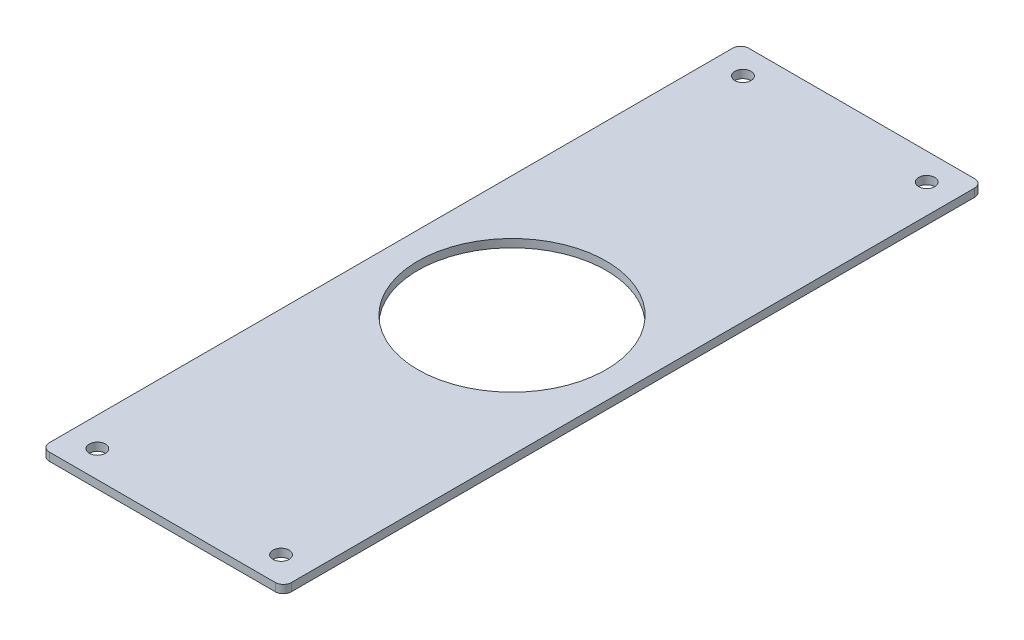
ISO-10303-21;
HEADER;
FILE_DESCRIPTION(('STEP AP214'),'2;1');
FILE_NAME('part.step','',(''),(''),'','','');
FILE_SCHEMA(('AUTOMOTIVE_DESIGN { 1 0 10303 214 1 1 1 1 }'));
ENDSEC;
DATA;
#1=APPLICATION_CONTEXT('core data for automotive mechanical design processes');
#2=APPLICATION_PROTOCOL_DEFINITION('international standard','automotive_design',2000,#1);
#3=PRODUCT_CONTEXT('',#1,'mechanical');
#4=PRODUCT('Part','Part','',(#3));
#5=PRODUCT_RELATED_PRODUCT_CATEGORY('part','',(#4));
#6=PRODUCT_DEFINITION_FORMATION('','',#4);
#7=PRODUCT_DEFINITION_CONTEXT('part definition',#1,'design');
#8=PRODUCT_DEFINITION('design','',#6,#7);
#9=PRODUCT_DEFINITION_SHAPE('','',#8);
#10=(LENGTH_UNIT() NAMED_UNIT(*) SI_UNIT(.MILLI.,.METRE.));
#11=(NAMED_UNIT(*) PLANE_ANGLE_UNIT() SI_UNIT($,.RADIAN.));
#12=(NAMED_UNIT(*) SI_UNIT($,.STERADIAN.) SOLID_ANGLE_UNIT());
#13=UNCERTAINTY_MEASURE_WITH_UNIT(LENGTH_MEASURE(1.E-05),#10,'distance_accuracy_value','');
#14=(GEOMETRIC_REPRESENTATION_CONTEXT(3) GLOBAL_UNCERTAINTY_ASSIGNED_CONTEXT((#13)) GLOBAL_UNIT_ASSIGNED_CONTEXT((#10,
#11,#12)) REPRESENTATION_CONTEXT('',''));
#15=CARTESIAN_POINT('',(0.,0.,0.));
#16=DIRECTION('',(0.,0.,1.));
#17=DIRECTION('',(1.,0.,0.));
#18=AXIS2_PLACEMENT_3D('',#15,#16,#17);
#19=CARTESIAN_POINT('',(0.,3.,0.));
#20=DIRECTION('',(0.,-1.,0.));
#21=DIRECTION('',(0.,0.,-1.));
#22=AXIS2_PLACEMENT_3D('',#19,#20,#21);
#23=PLANE('',#22);
#24=DIRECTION('',(-1.,0.,0.));
#25=VECTOR('',#24,1.);
#26=CARTESIAN_POINT('',(-45.,3.,-130.));
#27=LINE('',#26,#25);
#28=CARTESIAN_POINT('',(42.,3.,-130.));
#29=VERTEX_POINT('',#28);
#30=CARTESIAN_POINT('',(-42.,3.,-130.));
#31=VERTEX_POINT('',#30);
#32=EDGE_CURVE('E169',#29,#31,#27,.T.);
#33=ORIENTED_EDGE('',*,*,#32,.T.);
#34=CARTESIAN_POINT('',(-42.,3.,-127.));
#35=DIRECTION('',(0.,-1.,0.));
#36=DIRECTION('',(0.,0.,-1.));
#37=AXIS2_PLACEMENT_3D('',#34,#35,#36);
#38=CIRCLE('',#37,3.);
#39=CARTESIAN_POINT('',(-45.,3.,-127.));
#40=VERTEX_POINT('',#39);
#41=EDGE_CURVE('E149',#31,#40,#38,.F.);
#42=ORIENTED_EDGE('',*,*,#41,.T.);
#43=DIRECTION('',(0.,0.,1.));
#44=VECTOR('',#43,1.);
#45=CARTESIAN_POINT('',(-45.,3.,130.));
#46=LINE('',#45,#44);
#47=CARTESIAN_POINT('',(-45.,3.,127.));
#48=VERTEX_POINT('',#47);
#49=EDGE_CURVE('E119',#40,#48,#46,.T.);
#50=ORIENTED_EDGE('',*,*,#49,.T.);
#51=CARTESIAN_POINT('',(-42.,3.,127.));
#52=DIRECTION('',(0.,-1.,0.));
#53=DIRECTION('',(0.,0.,-1.));
#54=AXIS2_PLACEMENT_3D('',#51,#52,#53);
#55=CIRCLE('',#54,3.);
#56=CARTESIAN_POINT('',(-42.,3.,130.));
#57=VERTEX_POINT('',#56);
#58=EDGE_CURVE('E55',#48,#57,#55,.F.);
#59=ORIENTED_EDGE('',*,*,#58,.T.);
#60=DIRECTION('',(1.,0.,0.));
#61=VECTOR('',#60,1.);
#62=CARTESIAN_POINT('',(-45.,3.,130.));
#63=LINE('',#62,#61);
#64=CARTESIAN_POINT('',(42.,3.,130.));
#65=VERTEX_POINT('',#64);
#66=EDGE_CURVE('E136',#57,#65,#63,.T.);
#67=ORIENTED_EDGE('',*,*,#66,.T.);
#68=CARTESIAN_POINT('',(42.,3.,127.));
#69=DIRECTION('',(0.,-1.,0.));
#70=DIRECTION('',(0.,0.,-1.));
#71=AXIS2_PLACEMENT_3D('',#68,#69,#70);
#72=CIRCLE('',#71,3.);
#73=CARTESIAN_POINT('',(45.,3.,127.));
#74=VERTEX_POINT('',#73);
#75=EDGE_CURVE('E144',#65,#74,#72,.F.);
#76=ORIENTED_EDGE('',*,*,#75,.T.);
#77=DIRECTION('',(0.,0.,-1.));
#78=VECTOR('',#77,1.);
#79=CARTESIAN_POINT('',(45.,3.,130.));
#80=LINE('',#79,#78);
#81=CARTESIAN_POINT('',(45.,3.,-127.));
#82=VERTEX_POINT('',#81);
#83=EDGE_CURVE('E130',#74,#82,#80,.T.);
#84=ORIENTED_EDGE('',*,*,#83,.T.);
#85=CARTESIAN_POINT('',(42.,3.,-127.));
#86=DIRECTION('',(0.,-1.,0.));
#87=DIRECTION('',(0.,0.,-1.));
#88=AXIS2_PLACEMENT_3D('',#85,#86,#87);
#89=CIRCLE('',#88,3.);
#90=EDGE_CURVE('E147',#82,#29,#89,.F.);
#91=ORIENTED_EDGE('',*,*,#90,.T.);
#92=EDGE_LOOP('',(#33,#42,#50,#59,#67,#76,#84,#91));
#93=FACE_BOUND('',#92,.T.);
#94=CARTESIAN_POINT('',(0.,3.,0.));
#95=DIRECTION('',(0.,1.,0.));
#96=DIRECTION('',(0.,0.,1.));
#97=AXIS2_PLACEMENT_3D('',#94,#95,#96);
#98=CIRCLE('',#97,35.);
#99=CARTESIAN_POINT('',(0.,3.,35.));
#100=VERTEX_POINT('',#99);
#101=EDGE_CURVE('E175',#100,#100,#98,.T.);
#102=ORIENTED_EDGE('',*,*,#101,.F.);
#103=EDGE_LOOP('',(#102));
#104=FACE_BOUND('',#103,.T.);
#105=CARTESIAN_POINT('',(-34.15,3.,-120.));
#106=DIRECTION('',(0.,1.,0.));
#107=DIRECTION('',(0.,0.,1.));
#108=AXIS2_PLACEMENT_3D('',#105,#106,#107);
#109=CIRCLE('',#108,3.);
#110=CARTESIAN_POINT('',(-34.15,3.,-117.));
#111=VERTEX_POINT('',#110);
#112=EDGE_CURVE('E184',#111,#111,#109,.T.);
#113=ORIENTED_EDGE('',*,*,#112,.F.);
#114=EDGE_LOOP('',(#113));
#115=FACE_BOUND('',#114,.T.);
#116=CARTESIAN_POINT('',(34.15,3.,-120.));
#117=DIRECTION('',(0.,1.,0.));
#118=DIRECTION('',(0.,0.,-1.));
#119=AXIS2_PLACEMENT_3D('',#116,#117,#118);
#120=CIRCLE('',#119,3.);
#121=CARTESIAN_POINT('',(34.15,3.,-123.));
#122=VERTEX_POINT('',#121);
#123=EDGE_CURVE('E189',#122,#122,#120,.T.);
#124=ORIENTED_EDGE('',*,*,#123,.F.);
#125=EDGE_LOOP('',(#124));
#126=FACE_BOUND('',#125,.T.);
#127=CARTESIAN_POINT('',(34.15,3.,120.));
#128=DIRECTION('',(0.,1.,0.));
#129=DIRECTION('',(0.,0.,1.));
#130=AXIS2_PLACEMENT_3D('',#127,#128,#129);
#131=CIRCLE('',#130,3.);
#132=CARTESIAN_POINT('',(34.15,3.,123.));
#133=VERTEX_POINT('',#132);
#134=EDGE_CURVE('E195',#133,#133,#131,.T.);
#135=ORIENTED_EDGE('',*,*,#134,.F.);
#136=EDGE_LOOP('',(#135));
#137=FACE_BOUND('',#136,.T.);
#138=CARTESIAN_POINT('',(-34.15,3.,120.));
#139=DIRECTION('',(0.,1.,0.));
#140=DIRECTION('',(0.,0.,-1.));
#141=AXIS2_PLACEMENT_3D('',#138,#139,#140);
#142=CIRCLE('',#141,3.);
#143=CARTESIAN_POINT('',(-34.15,3.,117.));
#144=VERTEX_POINT('',#143);
#145=EDGE_CURVE('E201',#144,#144,#142,.T.);
#146=ORIENTED_EDGE('',*,*,#145,.F.);
#147=EDGE_LOOP('',(#146));
#148=FACE_BOUND('',#147,.T.);
#149=ADVANCED_FACE('F34',(#93,#104,#115,#126,#137,#148),#23,.F.);
#150=CARTESIAN_POINT('',(0.,0.,0.));
#151=DIRECTION('',(0.,-1.,0.));
#152=DIRECTION('',(0.,0.,-1.));
#153=AXIS2_PLACEMENT_3D('',#150,#151,#152);
#154=PLANE('',#153);
#155=CARTESIAN_POINT('',(34.15,0.,120.));
#156=DIRECTION('',(0.,1.,0.));
#157=DIRECTION('',(0.,0.,1.));
#158=AXIS2_PLACEMENT_3D('',#155,#156,#157);
#159=CIRCLE('',#158,3.);
#160=CARTESIAN_POINT('',(34.15,0.,123.));
#161=VERTEX_POINT('',#160);
#162=EDGE_CURVE('E198',#161,#161,#159,.T.);
#163=ORIENTED_EDGE('',*,*,#162,.T.);
#164=EDGE_LOOP('',(#163));
#165=FACE_BOUND('',#164,.T.);
#166=CARTESIAN_POINT('',(-34.15,0.,-120.));
#167=DIRECTION('',(0.,1.,0.));
#168=DIRECTION('',(0.,0.,1.));
#169=AXIS2_PLACEMENT_3D('',#166,#167,#168);
#170=CIRCLE('',#169,3.);
#171=CARTESIAN_POINT('',(-34.15,0.,-117.));
#172=VERTEX_POINT('',#171);
#173=EDGE_CURVE('E186',#172,#172,#170,.T.);
#174=ORIENTED_EDGE('',*,*,#173,.T.);
#175=EDGE_LOOP('',(#174));
#176=FACE_BOUND('',#175,.T.);
#177=DIRECTION('',(0.,0.,1.));
#178=VECTOR('',#177,1.);
#179=CARTESIAN_POINT('',(-45.,0.,130.));
#180=LINE('',#179,#178);
#181=CARTESIAN_POINT('',(-45.,0.,-127.));
#182=VERTEX_POINT('',#181);
#183=CARTESIAN_POINT('',(-45.,0.,127.));
#184=VERTEX_POINT('',#183);
#185=EDGE_CURVE('E117',#182,#184,#180,.T.);
#186=ORIENTED_EDGE('',*,*,#185,.F.);
#187=CARTESIAN_POINT('',(-42.,0.,-127.));
#188=DIRECTION('',(0.,-1.,0.));
#189=DIRECTION('',(0.,0.,-1.));
#190=AXIS2_PLACEMENT_3D('',#187,#188,#189);
#191=CIRCLE('',#190,3.);
#192=CARTESIAN_POINT('',(-42.,0.,-130.));
#193=VERTEX_POINT('',#192);
#194=EDGE_CURVE('E100',#182,#193,#191,.T.);
#195=ORIENTED_EDGE('',*,*,#194,.T.);
#196=DIRECTION('',(-1.,0.,0.));
#197=VECTOR('',#196,1.);
#198=CARTESIAN_POINT('',(-45.,0.,-130.));
#199=LINE('',#198,#197);
#200=CARTESIAN_POINT('',(42.,0.,-130.));
#201=VERTEX_POINT('',#200);
#202=EDGE_CURVE('E128',#201,#193,#199,.T.);
#203=ORIENTED_EDGE('',*,*,#202,.F.);
#204=CARTESIAN_POINT('',(42.,0.,-127.));
#205=DIRECTION('',(0.,-1.,0.));
#206=DIRECTION('',(0.,0.,-1.));
#207=AXIS2_PLACEMENT_3D('',#204,#205,#206);
#208=CIRCLE('',#207,3.);
#209=CARTESIAN_POINT('',(45.,0.,-127.));
#210=VERTEX_POINT('',#209);
#211=EDGE_CURVE('E111',#201,#210,#208,.T.);
#212=ORIENTED_EDGE('',*,*,#211,.T.);
#213=DIRECTION('',(0.,0.,-1.));
#214=VECTOR('',#213,1.);
#215=CARTESIAN_POINT('',(45.,0.,130.));
#216=LINE('',#215,#214);
#217=CARTESIAN_POINT('',(45.,0.,127.));
#218=VERTEX_POINT('',#217);
#219=EDGE_CURVE('E132',#218,#210,#216,.T.);
#220=ORIENTED_EDGE('',*,*,#219,.F.);
#221=CARTESIAN_POINT('',(42.,0.,127.));
#222=DIRECTION('',(0.,-1.,0.));
#223=DIRECTION('',(0.,0.,-1.));
#224=AXIS2_PLACEMENT_3D('',#221,#222,#223);
#225=CIRCLE('',#224,3.);
#226=CARTESIAN_POINT('',(42.,0.,130.));
#227=VERTEX_POINT('',#226);
#228=EDGE_CURVE('E120',#218,#227,#225,.T.);
#229=ORIENTED_EDGE('',*,*,#228,.T.);
#230=DIRECTION('',(1.,0.,0.));
#231=VECTOR('',#230,1.);
#232=CARTESIAN_POINT('',(-45.,0.,130.));
#233=LINE('',#232,#231);
#234=CARTESIAN_POINT('',(-42.,0.,130.));
#235=VERTEX_POINT('',#234);
#236=EDGE_CURVE('E127',#235,#227,#233,.T.);
#237=ORIENTED_EDGE('',*,*,#236,.F.);
#238=CARTESIAN_POINT('',(-42.,0.,127.));
#239=DIRECTION('',(0.,-1.,0.));
#240=DIRECTION('',(0.,0.,-1.));
#241=AXIS2_PLACEMENT_3D('',#238,#239,#240);
#242=CIRCLE('',#241,3.);
#243=EDGE_CURVE('E126',#235,#184,#242,.T.);
#244=ORIENTED_EDGE('',*,*,#243,.T.);
#245=EDGE_LOOP('',(#186,#195,#203,#212,#220,#229,#237,#244));
#246=FACE_BOUND('',#245,.T.);
#247=CARTESIAN_POINT('',(0.,0.,0.));
#248=DIRECTION('',(0.,1.,0.));
#249=DIRECTION('',(0.,0.,1.));
#250=AXIS2_PLACEMENT_3D('',#247,#248,#249);
#251=CIRCLE('',#250,35.);
#252=CARTESIAN_POINT('',(0.,0.,35.));
#253=VERTEX_POINT('',#252);
#254=EDGE_CURVE('E177',#253,#253,#251,.T.);
#255=ORIENTED_EDGE('',*,*,#254,.T.);
#256=EDGE_LOOP('',(#255));
#257=FACE_BOUND('',#256,.T.);
#258=CARTESIAN_POINT('',(34.15,0.,-120.));
#259=DIRECTION('',(0.,1.,0.));
#260=DIRECTION('',(0.,0.,-1.));
#261=AXIS2_PLACEMENT_3D('',#258,#259,#260);
#262=CIRCLE('',#261,3.);
#263=CARTESIAN_POINT('',(34.15,0.,-123.));
#264=VERTEX_POINT('',#263);
#265=EDGE_CURVE('E192',#264,#264,#262,.T.);
#266=ORIENTED_EDGE('',*,*,#265,.T.);
#267=EDGE_LOOP('',(#266));
#268=FACE_BOUND('',#267,.T.);
#269=CARTESIAN_POINT('',(-34.15,0.,120.));
#270=DIRECTION('',(0.,1.,0.));
#271=DIRECTION('',(0.,0.,-1.));
#272=AXIS2_PLACEMENT_3D('',#269,#270,#271);
#273=CIRCLE('',#272,3.);
#274=CARTESIAN_POINT('',(-34.15,0.,117.));
#275=VERTEX_POINT('',#274);
#276=EDGE_CURVE('E204',#275,#275,#273,.T.);
#277=ORIENTED_EDGE('',*,*,#276,.T.);
#278=EDGE_LOOP('',(#277));
#279=FACE_BOUND('',#278,.T.);
#280=ADVANCED_FACE('F123',(#165,#176,#246,#257,#268,#279),#154,.T.);
#281=CARTESIAN_POINT('',(45.,3.,130.));
#282=DIRECTION('',(-1.,0.,0.));
#283=DIRECTION('',(0.,0.,1.));
#284=AXIS2_PLACEMENT_3D('',#281,#282,#283);
#285=PLANE('',#284);
#286=ORIENTED_EDGE('',*,*,#219,.T.);
#287=DIRECTION('',(0.,-1.,0.));
#288=VECTOR('',#287,1.);
#289=CARTESIAN_POINT('',(45.,3.,-127.));
#290=LINE('',#289,#288);
#291=EDGE_CURVE('E154',#210,#82,#290,.F.);
#292=ORIENTED_EDGE('',*,*,#291,.T.);
#293=ORIENTED_EDGE('',*,*,#83,.F.);
#294=DIRECTION('',(0.,-1.,0.));
#295=VECTOR('',#294,1.);
#296=CARTESIAN_POINT('',(45.,3.,127.));
#297=LINE('',#296,#295);
#298=EDGE_CURVE('E151',#74,#218,#297,.T.);
#299=ORIENTED_EDGE('',*,*,#298,.T.);
#300=EDGE_LOOP('',(#286,#292,#293,#299));
#301=FACE_BOUND('',#300,.T.);
#302=ADVANCED_FACE('F160',(#301),#285,.F.);
#303=CARTESIAN_POINT('',(-45.,3.,-130.));
#304=DIRECTION('',(0.,0.,1.));
#305=DIRECTION('',(1.,0.,0.));
#306=AXIS2_PLACEMENT_3D('',#303,#304,#305);
#307=PLANE('',#306);
#308=ORIENTED_EDGE('',*,*,#202,.T.);
#309=DIRECTION('',(0.,-1.,0.));
#310=VECTOR('',#309,1.);
#311=CARTESIAN_POINT('',(-42.,3.,-130.));
#312=LINE('',#311,#310);
#313=EDGE_CURVE('E105',#193,#31,#312,.F.);
#314=ORIENTED_EDGE('',*,*,#313,.T.);
#315=ORIENTED_EDGE('',*,*,#32,.F.);
#316=DIRECTION('',(0.,-1.,0.));
#317=VECTOR('',#316,1.);
#318=CARTESIAN_POINT('',(42.,3.,-130.));
#319=LINE('',#318,#317);
#320=EDGE_CURVE('E110',#29,#201,#319,.T.);
#321=ORIENTED_EDGE('',*,*,#320,.T.);
#322=EDGE_LOOP('',(#308,#314,#315,#321));
#323=FACE_BOUND('',#322,.T.);
#324=ADVANCED_FACE('F174',(#323),#307,.F.);
#325=CARTESIAN_POINT('',(-45.,3.,130.));
#326=DIRECTION('',(1.,0.,0.));
#327=DIRECTION('',(0.,0.,-1.));
#328=AXIS2_PLACEMENT_3D('',#325,#326,#327);
#329=PLANE('',#328);
#330=ORIENTED_EDGE('',*,*,#49,.F.);
#331=DIRECTION('',(0.,-1.,0.));
#332=VECTOR('',#331,1.);
#333=CARTESIAN_POINT('',(-45.,3.,-127.));
#334=LINE('',#333,#332);
#335=EDGE_CURVE('E104',#40,#182,#334,.T.);
#336=ORIENTED_EDGE('',*,*,#335,.T.);
#337=ORIENTED_EDGE('',*,*,#185,.T.);
#338=DIRECTION('',(0.,-1.,0.));
#339=VECTOR('',#338,1.);
#340=CARTESIAN_POINT('',(-45.,3.,127.));
#341=LINE('',#340,#339);
#342=EDGE_CURVE('E121',#184,#48,#341,.F.);
#343=ORIENTED_EDGE('',*,*,#342,.T.);
#344=EDGE_LOOP('',(#330,#336,#337,#343));
#345=FACE_BOUND('',#344,.T.);
#346=ADVANCED_FACE('F116',(#345),#329,.F.);
#347=CARTESIAN_POINT('',(-45.,3.,130.));
#348=DIRECTION('',(0.,0.,-1.));
#349=DIRECTION('',(-1.,0.,0.));
#350=AXIS2_PLACEMENT_3D('',#347,#348,#349);
#351=PLANE('',#350);
#352=ORIENTED_EDGE('',*,*,#66,.F.);
#353=DIRECTION('',(0.,-1.,0.));
#354=VECTOR('',#353,1.);
#355=CARTESIAN_POINT('',(-42.,3.,130.));
#356=LINE('',#355,#354);
#357=EDGE_CURVE('E11',#57,#235,#356,.T.);
#358=ORIENTED_EDGE('',*,*,#357,.T.);
#359=ORIENTED_EDGE('',*,*,#236,.T.);
#360=DIRECTION('',(0.,-1.,0.));
#361=VECTOR('',#360,1.);
#362=CARTESIAN_POINT('',(42.,3.,130.));
#363=LINE('',#362,#361);
#364=EDGE_CURVE('E42',#227,#65,#363,.F.);
#365=ORIENTED_EDGE('',*,*,#364,.T.);
#366=EDGE_LOOP('',(#352,#358,#359,#365));
#367=FACE_BOUND('',#366,.T.);
#368=ADVANCED_FACE('F224',(#367),#351,.F.);
#369=CARTESIAN_POINT('',(0.,3.,0.));
#370=DIRECTION('',(0.,-1.,0.));
#371=DIRECTION('',(0.,0.,-1.));
#372=AXIS2_PLACEMENT_3D('',#369,#370,#371);
#373=CYLINDRICAL_SURFACE('',#372,35.);
#374=ORIENTED_EDGE('',*,*,#101,.T.);
#375=EDGE_LOOP('',(#374));
#376=FACE_BOUND('',#375,.T.);
#377=ORIENTED_EDGE('',*,*,#254,.F.);
#378=EDGE_LOOP('',(#377));
#379=FACE_BOUND('',#378,.T.);
#380=ADVANCED_FACE('F221',(#376,#379),#373,.F.);
#381=CARTESIAN_POINT('',(-34.15,3.,-120.));
#382=DIRECTION('',(0.,-1.,0.));
#383=DIRECTION('',(0.,0.,-1.));
#384=AXIS2_PLACEMENT_3D('',#381,#382,#383);
#385=CYLINDRICAL_SURFACE('',#384,3.);
#386=ORIENTED_EDGE('',*,*,#112,.T.);
#387=EDGE_LOOP('',(#386));
#388=FACE_BOUND('',#387,.T.);
#389=ORIENTED_EDGE('',*,*,#173,.F.);
#390=EDGE_LOOP('',(#389));
#391=FACE_BOUND('',#390,.T.);
#392=ADVANCED_FACE('F326',(#388,#391),#385,.F.);
#393=CARTESIAN_POINT('',(34.15,3.,-120.));
#394=DIRECTION('',(0.,-1.,0.));
#395=DIRECTION('',(0.,0.,-1.));
#396=AXIS2_PLACEMENT_3D('',#393,#394,#395);
#397=CYLINDRICAL_SURFACE('',#396,3.);
#398=ORIENTED_EDGE('',*,*,#123,.T.);
#399=EDGE_LOOP('',(#398));
#400=FACE_BOUND('',#399,.T.);
#401=ORIENTED_EDGE('',*,*,#265,.F.);
#402=EDGE_LOOP('',(#401));
#403=FACE_BOUND('',#402,.T.);
#404=ADVANCED_FACE('F316',(#400,#403),#397,.F.);
#405=CARTESIAN_POINT('',(34.15,3.,120.));
#406=DIRECTION('',(0.,-1.,0.));
#407=DIRECTION('',(0.,0.,-1.));
#408=AXIS2_PLACEMENT_3D('',#405,#406,#407);
#409=CYLINDRICAL_SURFACE('',#408,3.);
#410=ORIENTED_EDGE('',*,*,#134,.T.);
#411=EDGE_LOOP('',(#410));
#412=FACE_BOUND('',#411,.T.);
#413=ORIENTED_EDGE('',*,*,#162,.F.);
#414=EDGE_LOOP('',(#413));
#415=FACE_BOUND('',#414,.T.);
#416=ADVANCED_FACE('F307',(#412,#415),#409,.F.);
#417=CARTESIAN_POINT('',(-34.15,3.,120.));
#418=DIRECTION('',(0.,-1.,0.));
#419=DIRECTION('',(0.,0.,-1.));
#420=AXIS2_PLACEMENT_3D('',#417,#418,#419);
#421=CYLINDRICAL_SURFACE('',#420,3.);
#422=ORIENTED_EDGE('',*,*,#145,.T.);
#423=EDGE_LOOP('',(#422));
#424=FACE_BOUND('',#423,.T.);
#425=ORIENTED_EDGE('',*,*,#276,.F.);
#426=EDGE_LOOP('',(#425));
#427=FACE_BOUND('',#426,.T.);
#428=ADVANCED_FACE('F210',(#424,#427),#421,.F.);
#429=CARTESIAN_POINT('',(-42.,3.,-127.));
#430=DIRECTION('',(0.,-1.,0.));
#431=DIRECTION('',(0.,0.,-1.));
#432=AXIS2_PLACEMENT_3D('',#429,#430,#431);
#433=CYLINDRICAL_SURFACE('',#432,3.);
#434=ORIENTED_EDGE('',*,*,#41,.F.);
#435=ORIENTED_EDGE('',*,*,#313,.F.);
#436=ORIENTED_EDGE('',*,*,#194,.F.);
#437=ORIENTED_EDGE('',*,*,#335,.F.);
#438=EDGE_LOOP('',(#434,#435,#436,#437));
#439=FACE_BOUND('',#438,.T.);
#440=ADVANCED_FACE('F103',(#439),#433,.T.);
#441=CARTESIAN_POINT('',(42.,3.,-127.));
#442=DIRECTION('',(0.,-1.,0.));
#443=DIRECTION('',(0.,0.,-1.));
#444=AXIS2_PLACEMENT_3D('',#441,#442,#443);
#445=CYLINDRICAL_SURFACE('',#444,3.);
#446=ORIENTED_EDGE('',*,*,#90,.F.);
#447=ORIENTED_EDGE('',*,*,#291,.F.);
#448=ORIENTED_EDGE('',*,*,#211,.F.);
#449=ORIENTED_EDGE('',*,*,#320,.F.);
#450=EDGE_LOOP('',(#446,#447,#448,#449));
#451=FACE_BOUND('',#450,.T.);
#452=ADVANCED_FACE('F172',(#451),#445,.T.);
#453=CARTESIAN_POINT('',(-42.,3.,127.));
#454=DIRECTION('',(0.,-1.,0.));
#455=DIRECTION('',(0.,0.,-1.));
#456=AXIS2_PLACEMENT_3D('',#453,#454,#455);
#457=CYLINDRICAL_SURFACE('',#456,3.);
#458=ORIENTED_EDGE('',*,*,#58,.F.);
#459=ORIENTED_EDGE('',*,*,#342,.F.);
#460=ORIENTED_EDGE('',*,*,#243,.F.);
#461=ORIENTED_EDGE('',*,*,#357,.F.);
#462=EDGE_LOOP('',(#458,#459,#460,#461));
#463=FACE_BOUND('',#462,.T.);
#464=ADVANCED_FACE('F236',(#463),#457,.T.);
#465=CARTESIAN_POINT('',(42.,3.,127.));
#466=DIRECTION('',(0.,-1.,0.));
#467=DIRECTION('',(0.,0.,-1.));
#468=AXIS2_PLACEMENT_3D('',#465,#466,#467);
#469=CYLINDRICAL_SURFACE('',#468,3.);
#470=ORIENTED_EDGE('',*,*,#75,.F.);
#471=ORIENTED_EDGE('',*,*,#364,.F.);
#472=ORIENTED_EDGE('',*,*,#228,.F.);
#473=ORIENTED_EDGE('',*,*,#298,.F.);
#474=EDGE_LOOP('',(#470,#471,#472,#473));
#475=FACE_BOUND('',#474,.T.);
#476=ADVANCED_FACE('F36',(#475),#469,.T.);
#477=CLOSED_SHELL('',(#149,#280,#302,#324,#346,#368,#380,#392,#404,#416,#428,#440,#452,#464,#476));
#478=MANIFOLD_SOLID_BREP('B2',#477);
#479=ADVANCED_BREP_SHAPE_REPRESENTATION('',(#18,#478),#14);
#480=SHAPE_DEFINITION_REPRESENTATION(#9,#479);
ENDSEC;
END-ISO-10303-21;
